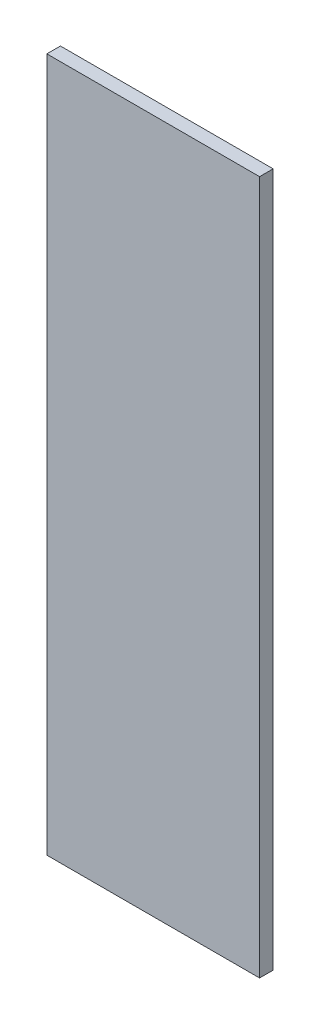
ISO-10303-21;
HEADER;
FILE_DESCRIPTION(('STEP AP214'),'2;1');
FILE_NAME('part.step','',(''),(''),'','','');
FILE_SCHEMA(('AUTOMOTIVE_DESIGN { 1 0 10303 214 1 1 1 1 }'));
ENDSEC;
DATA;
#1=APPLICATION_CONTEXT('core data for automotive mechanical design processes');
#2=APPLICATION_PROTOCOL_DEFINITION('international standard','automotive_design',2000,#1);
#3=PRODUCT_CONTEXT('',#1,'mechanical');
#4=PRODUCT('Part','Part','',(#3));
#5=PRODUCT_RELATED_PRODUCT_CATEGORY('part','',(#4));
#6=PRODUCT_DEFINITION_FORMATION('','',#4);
#7=PRODUCT_DEFINITION_CONTEXT('part definition',#1,'design');
#8=PRODUCT_DEFINITION('design','',#6,#7);
#9=PRODUCT_DEFINITION_SHAPE('','',#8);
#10=(LENGTH_UNIT() NAMED_UNIT(*) SI_UNIT(.MILLI.,.METRE.));
#11=(NAMED_UNIT(*) PLANE_ANGLE_UNIT() SI_UNIT($,.RADIAN.));
#12=(NAMED_UNIT(*) SI_UNIT($,.STERADIAN.) SOLID_ANGLE_UNIT());
#13=UNCERTAINTY_MEASURE_WITH_UNIT(LENGTH_MEASURE(1.E-05),#10,'distance_accuracy_value','');
#14=(GEOMETRIC_REPRESENTATION_CONTEXT(3) GLOBAL_UNCERTAINTY_ASSIGNED_CONTEXT((#13)) GLOBAL_UNIT_ASSIGNED_CONTEXT((#10,
#11,#12)) REPRESENTATION_CONTEXT('',''));
#15=CARTESIAN_POINT('',(0.,0.,0.));
#16=DIRECTION('',(0.,0.,1.));
#17=DIRECTION('',(1.,0.,0.));
#18=AXIS2_PLACEMENT_3D('',#15,#16,#17);
#19=CARTESIAN_POINT('',(-141.,-460.,18.));
#20=DIRECTION('',(1.,0.,0.));
#21=DIRECTION('',(0.,0.,-1.));
#22=AXIS2_PLACEMENT_3D('',#19,#20,#21);
#23=PLANE('',#22);
#24=DIRECTION('',(0.,-1.,0.));
#25=VECTOR('',#24,1.);
#26=CARTESIAN_POINT('',(-141.,-460.,0.));
#27=LINE('',#26,#25);
#28=CARTESIAN_POINT('',(-141.,460.,0.));
#29=VERTEX_POINT('',#28);
#30=CARTESIAN_POINT('',(-141.,-460.,0.));
#31=VERTEX_POINT('',#30);
#32=EDGE_CURVE('E98',#29,#31,#27,.T.);
#33=ORIENTED_EDGE('',*,*,#32,.T.);
#34=DIRECTION('',(0.,0.,-1.));
#35=VECTOR('',#34,1.);
#36=CARTESIAN_POINT('',(-141.,-460.,18.));
#37=LINE('',#36,#35);
#38=CARTESIAN_POINT('',(-141.,-460.,18.));
#39=VERTEX_POINT('',#38);
#40=EDGE_CURVE('E11',#39,#31,#37,.T.);
#41=ORIENTED_EDGE('',*,*,#40,.F.);
#42=DIRECTION('',(0.,-1.,0.));
#43=VECTOR('',#42,1.);
#44=CARTESIAN_POINT('',(-141.,-460.,18.));
#45=LINE('',#44,#43);
#46=CARTESIAN_POINT('',(-141.,460.,18.));
#47=VERTEX_POINT('',#46);
#48=EDGE_CURVE('E86',#47,#39,#45,.T.);
#49=ORIENTED_EDGE('',*,*,#48,.F.);
#50=DIRECTION('',(0.,0.,-1.));
#51=VECTOR('',#50,1.);
#52=CARTESIAN_POINT('',(-141.,460.,18.));
#53=LINE('',#52,#51);
#54=EDGE_CURVE('E94',#47,#29,#53,.T.);
#55=ORIENTED_EDGE('',*,*,#54,.T.);
#56=EDGE_LOOP('',(#33,#41,#49,#55));
#57=FACE_BOUND('',#56,.T.);
#58=ADVANCED_FACE('F35',(#57),#23,.F.);
#59=CARTESIAN_POINT('',(141.,-460.,18.));
#60=DIRECTION('',(0.,1.,0.));
#61=DIRECTION('',(-1.,0.,0.));
#62=AXIS2_PLACEMENT_3D('',#59,#60,#61);
#63=PLANE('',#62);
#64=DIRECTION('',(1.,0.,0.));
#65=VECTOR('',#64,1.);
#66=CARTESIAN_POINT('',(141.,-460.,0.));
#67=LINE('',#66,#65);
#68=CARTESIAN_POINT('',(141.,-460.,0.));
#69=VERTEX_POINT('',#68);
#70=EDGE_CURVE('E90',#31,#69,#67,.T.);
#71=ORIENTED_EDGE('',*,*,#70,.T.);
#72=DIRECTION('',(0.,0.,-1.));
#73=VECTOR('',#72,1.);
#74=CARTESIAN_POINT('',(141.,-460.,18.));
#75=LINE('',#74,#73);
#76=CARTESIAN_POINT('',(141.,-460.,18.));
#77=VERTEX_POINT('',#76);
#78=EDGE_CURVE('E43',#77,#69,#75,.T.);
#79=ORIENTED_EDGE('',*,*,#78,.F.);
#80=DIRECTION('',(1.,0.,0.));
#81=VECTOR('',#80,1.);
#82=CARTESIAN_POINT('',(141.,-460.,18.));
#83=LINE('',#82,#81);
#84=EDGE_CURVE('E81',#39,#77,#83,.T.);
#85=ORIENTED_EDGE('',*,*,#84,.F.);
#86=ORIENTED_EDGE('',*,*,#40,.T.);
#87=EDGE_LOOP('',(#71,#79,#85,#86));
#88=FACE_BOUND('',#87,.T.);
#89=ADVANCED_FACE('F89',(#88),#63,.F.);
#90=CARTESIAN_POINT('',(141.,-460.,18.));
#91=DIRECTION('',(-1.,0.,0.));
#92=DIRECTION('',(0.,0.,1.));
#93=AXIS2_PLACEMENT_3D('',#90,#91,#92);
#94=PLANE('',#93);
#95=DIRECTION('',(0.,1.,0.));
#96=VECTOR('',#95,1.);
#97=CARTESIAN_POINT('',(141.,-460.,0.));
#98=LINE('',#97,#96);
#99=CARTESIAN_POINT('',(141.,460.,0.));
#100=VERTEX_POINT('',#99);
#101=EDGE_CURVE('E68',#69,#100,#98,.T.);
#102=ORIENTED_EDGE('',*,*,#101,.T.);
#103=DIRECTION('',(0.,0.,-1.));
#104=VECTOR('',#103,1.);
#105=CARTESIAN_POINT('',(141.,460.,18.));
#106=LINE('',#105,#104);
#107=CARTESIAN_POINT('',(141.,460.,18.));
#108=VERTEX_POINT('',#107);
#109=EDGE_CURVE('E91',#108,#100,#106,.T.);
#110=ORIENTED_EDGE('',*,*,#109,.F.);
#111=DIRECTION('',(0.,1.,0.));
#112=VECTOR('',#111,1.);
#113=CARTESIAN_POINT('',(141.,-460.,18.));
#114=LINE('',#113,#112);
#115=EDGE_CURVE('E84',#77,#108,#114,.T.);
#116=ORIENTED_EDGE('',*,*,#115,.F.);
#117=ORIENTED_EDGE('',*,*,#78,.T.);
#118=EDGE_LOOP('',(#102,#110,#116,#117));
#119=FACE_BOUND('',#118,.T.);
#120=ADVANCED_FACE('F92',(#119),#94,.F.);
#121=CARTESIAN_POINT('',(141.,460.,18.));
#122=DIRECTION('',(0.,-1.,0.));
#123=DIRECTION('',(1.,0.,0.));
#124=AXIS2_PLACEMENT_3D('',#121,#122,#123);
#125=PLANE('',#124);
#126=DIRECTION('',(-1.,0.,0.));
#127=VECTOR('',#126,1.);
#128=CARTESIAN_POINT('',(141.,460.,0.));
#129=LINE('',#128,#127);
#130=EDGE_CURVE('E74',#100,#29,#129,.T.);
#131=ORIENTED_EDGE('',*,*,#130,.T.);
#132=ORIENTED_EDGE('',*,*,#54,.F.);
#133=DIRECTION('',(-1.,0.,0.));
#134=VECTOR('',#133,1.);
#135=CARTESIAN_POINT('',(141.,460.,18.));
#136=LINE('',#135,#134);
#137=EDGE_CURVE('E51',#108,#47,#136,.T.);
#138=ORIENTED_EDGE('',*,*,#137,.F.);
#139=ORIENTED_EDGE('',*,*,#109,.T.);
#140=EDGE_LOOP('',(#131,#132,#138,#139));
#141=FACE_BOUND('',#140,.T.);
#142=ADVANCED_FACE('F105',(#141),#125,.F.);
#143=CARTESIAN_POINT('',(0.,0.,18.));
#144=DIRECTION('',(0.,0.,1.));
#145=DIRECTION('',(1.,0.,0.));
#146=AXIS2_PLACEMENT_3D('',#143,#144,#145);
#147=PLANE('',#146);
#148=ORIENTED_EDGE('',*,*,#48,.T.);
#149=ORIENTED_EDGE('',*,*,#84,.T.);
#150=ORIENTED_EDGE('',*,*,#115,.T.);
#151=ORIENTED_EDGE('',*,*,#137,.T.);
#152=EDGE_LOOP('',(#148,#149,#150,#151));
#153=FACE_BOUND('',#152,.T.);
#154=ADVANCED_FACE('F82',(#153),#147,.T.);
#155=CARTESIAN_POINT('',(0.,0.,0.));
#156=DIRECTION('',(0.,0.,1.));
#157=DIRECTION('',(1.,0.,0.));
#158=AXIS2_PLACEMENT_3D('',#155,#156,#157);
#159=PLANE('',#158);
#160=ORIENTED_EDGE('',*,*,#32,.F.);
#161=ORIENTED_EDGE('',*,*,#130,.F.);
#162=ORIENTED_EDGE('',*,*,#101,.F.);
#163=ORIENTED_EDGE('',*,*,#70,.F.);
#164=EDGE_LOOP('',(#160,#161,#162,#163));
#165=FACE_BOUND('',#164,.T.);
#166=ADVANCED_FACE('F108',(#165),#159,.F.);
#167=CLOSED_SHELL('',(#58,#89,#120,#142,#154,#166));
#168=MANIFOLD_SOLID_BREP('B2',#167);
#169=ADVANCED_BREP_SHAPE_REPRESENTATION('',(#18,#168),#14);
#170=SHAPE_DEFINITION_REPRESENTATION(#9,#169);
ENDSEC;
END-ISO-10303-21;
